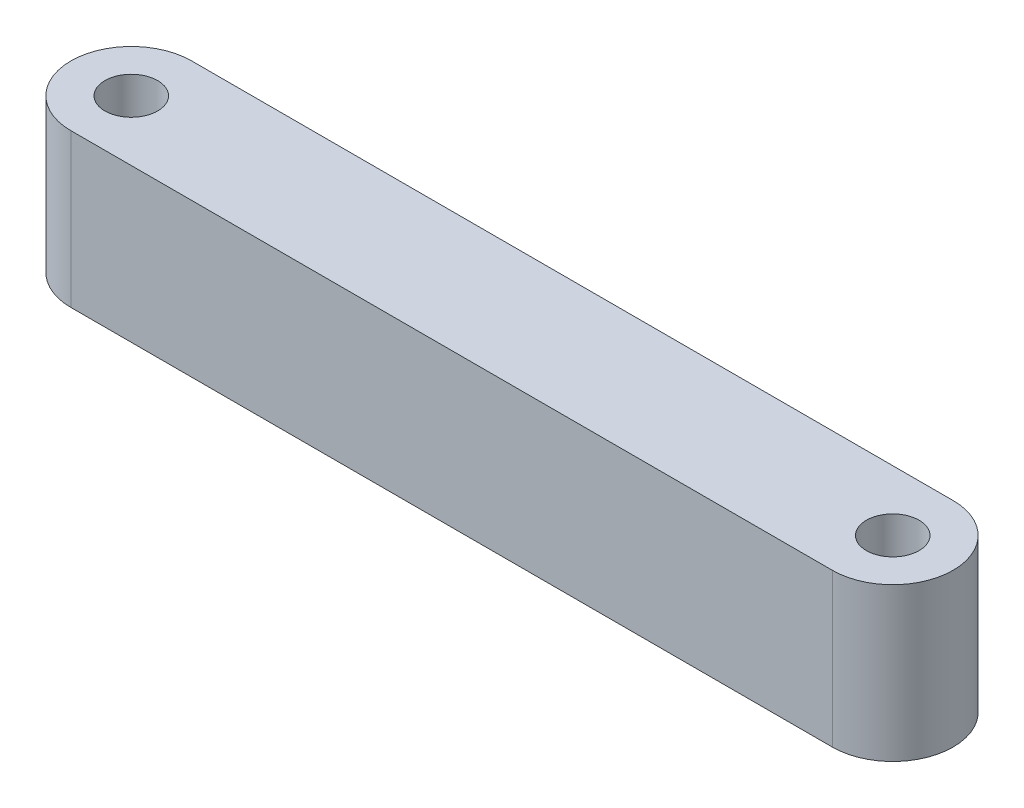
ISO-10303-21;
HEADER;
FILE_DESCRIPTION(('STEP AP214'),'2;1');
FILE_NAME('part.step','',(''),(''),'','','');
FILE_SCHEMA(('AUTOMOTIVE_DESIGN { 1 0 10303 214 1 1 1 1 }'));
ENDSEC;
DATA;
#1=APPLICATION_CONTEXT('core data for automotive mechanical design processes');
#2=APPLICATION_PROTOCOL_DEFINITION('international standard','automotive_design',2000,#1);
#3=PRODUCT_CONTEXT('',#1,'mechanical');
#4=PRODUCT('Part','Part','',(#3));
#5=PRODUCT_RELATED_PRODUCT_CATEGORY('part','',(#4));
#6=PRODUCT_DEFINITION_FORMATION('','',#4);
#7=PRODUCT_DEFINITION_CONTEXT('part definition',#1,'design');
#8=PRODUCT_DEFINITION('design','',#6,#7);
#9=PRODUCT_DEFINITION_SHAPE('','',#8);
#10=(LENGTH_UNIT() NAMED_UNIT(*) SI_UNIT(.MILLI.,.METRE.));
#11=(NAMED_UNIT(*) PLANE_ANGLE_UNIT() SI_UNIT($,.RADIAN.));
#12=(NAMED_UNIT(*) SI_UNIT($,.STERADIAN.) SOLID_ANGLE_UNIT());
#13=UNCERTAINTY_MEASURE_WITH_UNIT(LENGTH_MEASURE(1.E-05),#10,'distance_accuracy_value','');
#14=(GEOMETRIC_REPRESENTATION_CONTEXT(3) GLOBAL_UNCERTAINTY_ASSIGNED_CONTEXT((#13)) GLOBAL_UNIT_ASSIGNED_CONTEXT((#10,
#11,#12)) REPRESENTATION_CONTEXT('',''));
#15=CARTESIAN_POINT('',(0.,0.,0.));
#16=DIRECTION('',(0.,0.,1.));
#17=DIRECTION('',(1.,0.,0.));
#18=AXIS2_PLACEMENT_3D('',#15,#16,#17);
#19=CARTESIAN_POINT('',(-22.9449751224113,9.,0.));
#20=DIRECTION('',(0.,1.,0.));
#21=DIRECTION('',(0.,0.,1.));
#22=AXIS2_PLACEMENT_3D('',#19,#20,#21);
#23=PLANE('',#22);
#24=CARTESIAN_POINT('',(-22.9449751224113,9.,0.));
#25=DIRECTION('',(0.,1.,0.));
#26=DIRECTION('',(0.,0.,1.));
#27=AXIS2_PLACEMENT_3D('',#24,#25,#26);
#28=CIRCLE('',#27,1.55);
#29=CARTESIAN_POINT('',(-22.9449751224113,9.,1.55));
#30=VERTEX_POINT('',#29);
#31=EDGE_CURVE('E118',#30,#30,#28,.T.);
#32=ORIENTED_EDGE('',*,*,#31,.F.);
#33=EDGE_LOOP('',(#32));
#34=FACE_BOUND('',#33,.T.);
#35=CARTESIAN_POINT('',(-22.9449751224113,9.,0.));
#36=DIRECTION('',(0.,1.,0.));
#37=DIRECTION('',(0.,0.,1.));
#38=AXIS2_PLACEMENT_3D('',#35,#36,#37);
#39=CIRCLE('',#38,3.55);
#40=CARTESIAN_POINT('',(-22.9449751224113,9.,-3.55));
#41=VERTEX_POINT('',#40);
#42=CARTESIAN_POINT('',(-22.9449751224113,9.,3.55));
#43=VERTEX_POINT('',#42);
#44=EDGE_CURVE('E98',#41,#43,#39,.T.);
#45=ORIENTED_EDGE('',*,*,#44,.T.);
#46=DIRECTION('',(1.,0.,0.));
#47=VECTOR('',#46,1.);
#48=CARTESIAN_POINT('',(-22.9449751224113,9.,3.55));
#49=LINE('',#48,#47);
#50=CARTESIAN_POINT('',(21.8100248775887,9.,3.55));
#51=VERTEX_POINT('',#50);
#52=EDGE_CURVE('E93',#43,#51,#49,.T.);
#53=ORIENTED_EDGE('',*,*,#52,.T.);
#54=CARTESIAN_POINT('',(21.8100248775888,9.,0.));
#55=DIRECTION('',(0.,1.,0.));
#56=DIRECTION('',(0.,0.,1.));
#57=AXIS2_PLACEMENT_3D('',#54,#55,#56);
#58=CIRCLE('',#57,3.55);
#59=CARTESIAN_POINT('',(21.8100248775887,9.,-3.55));
#60=VERTEX_POINT('',#59);
#61=EDGE_CURVE('E96',#51,#60,#58,.T.);
#62=ORIENTED_EDGE('',*,*,#61,.T.);
#63=DIRECTION('',(-1.,0.,0.));
#64=VECTOR('',#63,1.);
#65=CARTESIAN_POINT('',(-22.9449751224113,9.,-3.55));
#66=LINE('',#65,#64);
#67=EDGE_CURVE('E63',#60,#41,#66,.T.);
#68=ORIENTED_EDGE('',*,*,#67,.T.);
#69=EDGE_LOOP('',(#45,#53,#62,#68));
#70=FACE_BOUND('',#69,.T.);
#71=CARTESIAN_POINT('',(21.8100248775888,9.,0.));
#72=DIRECTION('',(0.,1.,0.));
#73=DIRECTION('',(0.,0.,1.));
#74=AXIS2_PLACEMENT_3D('',#71,#72,#73);
#75=CIRCLE('',#74,1.55);
#76=CARTESIAN_POINT('',(21.8100248775888,9.,1.55));
#77=VERTEX_POINT('',#76);
#78=EDGE_CURVE('E140',#77,#77,#75,.T.);
#79=ORIENTED_EDGE('',*,*,#78,.F.);
#80=EDGE_LOOP('',(#79));
#81=FACE_BOUND('',#80,.T.);
#82=ADVANCED_FACE('F45',(#34,#70,#81),#23,.T.);
#83=CARTESIAN_POINT('',(-22.9449751224113,0.,0.));
#84=DIRECTION('',(0.,1.,0.));
#85=DIRECTION('',(0.,0.,1.));
#86=AXIS2_PLACEMENT_3D('',#83,#84,#85);
#87=PLANE('',#86);
#88=CARTESIAN_POINT('',(-22.9449751224113,0.,0.));
#89=DIRECTION('',(0.,1.,0.));
#90=DIRECTION('',(0.,0.,1.));
#91=AXIS2_PLACEMENT_3D('',#88,#89,#90);
#92=CIRCLE('',#91,3.55);
#93=CARTESIAN_POINT('',(-22.9449751224113,0.,-3.55));
#94=VERTEX_POINT('',#93);
#95=CARTESIAN_POINT('',(-22.9449751224113,0.,3.55));
#96=VERTEX_POINT('',#95);
#97=EDGE_CURVE('E114',#94,#96,#92,.T.);
#98=ORIENTED_EDGE('',*,*,#97,.F.);
#99=DIRECTION('',(-1.,0.,0.));
#100=VECTOR('',#99,1.);
#101=CARTESIAN_POINT('',(-22.9449751224113,0.,-3.55));
#102=LINE('',#101,#100);
#103=CARTESIAN_POINT('',(21.8100248775887,0.,-3.55));
#104=VERTEX_POINT('',#103);
#105=EDGE_CURVE('E86',#104,#94,#102,.T.);
#106=ORIENTED_EDGE('',*,*,#105,.F.);
#107=CARTESIAN_POINT('',(21.8100248775888,0.,0.));
#108=DIRECTION('',(0.,1.,0.));
#109=DIRECTION('',(0.,0.,1.));
#110=AXIS2_PLACEMENT_3D('',#107,#108,#109);
#111=CIRCLE('',#110,3.55);
#112=CARTESIAN_POINT('',(21.8100248775887,0.,3.55));
#113=VERTEX_POINT('',#112);
#114=EDGE_CURVE('E80',#113,#104,#111,.T.);
#115=ORIENTED_EDGE('',*,*,#114,.F.);
#116=DIRECTION('',(1.,0.,0.));
#117=VECTOR('',#116,1.);
#118=CARTESIAN_POINT('',(-22.9449751224113,0.,3.55));
#119=LINE('',#118,#117);
#120=EDGE_CURVE('E103',#96,#113,#119,.T.);
#121=ORIENTED_EDGE('',*,*,#120,.F.);
#122=EDGE_LOOP('',(#98,#106,#115,#121));
#123=FACE_BOUND('',#122,.T.);
#124=CARTESIAN_POINT('',(-22.9449751224113,0.,0.));
#125=DIRECTION('',(0.,1.,0.));
#126=DIRECTION('',(0.,0.,1.));
#127=AXIS2_PLACEMENT_3D('',#124,#125,#126);
#128=CIRCLE('',#127,1.55);
#129=CARTESIAN_POINT('',(-22.9449751224113,0.,1.55));
#130=VERTEX_POINT('',#129);
#131=EDGE_CURVE('E136',#130,#130,#128,.T.);
#132=ORIENTED_EDGE('',*,*,#131,.T.);
#133=EDGE_LOOP('',(#132));
#134=FACE_BOUND('',#133,.T.);
#135=CARTESIAN_POINT('',(21.8100248775888,0.,0.));
#136=DIRECTION('',(0.,1.,0.));
#137=DIRECTION('',(0.,0.,1.));
#138=AXIS2_PLACEMENT_3D('',#135,#136,#137);
#139=CIRCLE('',#138,1.55);
#140=CARTESIAN_POINT('',(21.8100248775888,0.,1.55));
#141=VERTEX_POINT('',#140);
#142=EDGE_CURVE('E144',#141,#141,#139,.T.);
#143=ORIENTED_EDGE('',*,*,#142,.T.);
#144=EDGE_LOOP('',(#143));
#145=FACE_BOUND('',#144,.T.);
#146=ADVANCED_FACE('F131',(#123,#134,#145),#87,.F.);
#147=CARTESIAN_POINT('',(-22.9449751224113,9.,0.));
#148=DIRECTION('',(0.,-1.,0.));
#149=DIRECTION('',(0.,0.,-1.));
#150=AXIS2_PLACEMENT_3D('',#147,#148,#149);
#151=CYLINDRICAL_SURFACE('',#150,3.55);
#152=ORIENTED_EDGE('',*,*,#97,.T.);
#153=DIRECTION('',(0.,-1.,0.));
#154=VECTOR('',#153,1.);
#155=CARTESIAN_POINT('',(-22.9449751224113,9.,3.55));
#156=LINE('',#155,#154);
#157=EDGE_CURVE('E11',#43,#96,#156,.T.);
#158=ORIENTED_EDGE('',*,*,#157,.F.);
#159=ORIENTED_EDGE('',*,*,#44,.F.);
#160=DIRECTION('',(0.,-1.,0.));
#161=VECTOR('',#160,1.);
#162=CARTESIAN_POINT('',(-22.9449751224113,9.,-3.55));
#163=LINE('',#162,#161);
#164=EDGE_CURVE('E110',#41,#94,#163,.T.);
#165=ORIENTED_EDGE('',*,*,#164,.T.);
#166=EDGE_LOOP('',(#152,#158,#159,#165));
#167=FACE_BOUND('',#166,.T.);
#168=ADVANCED_FACE('F47',(#167),#151,.T.);
#169=CARTESIAN_POINT('',(-22.9449751224113,9.,3.55));
#170=DIRECTION('',(0.,0.,-1.));
#171=DIRECTION('',(-1.,0.,0.));
#172=AXIS2_PLACEMENT_3D('',#169,#170,#171);
#173=PLANE('',#172);
#174=ORIENTED_EDGE('',*,*,#120,.T.);
#175=DIRECTION('',(0.,-1.,0.));
#176=VECTOR('',#175,1.);
#177=CARTESIAN_POINT('',(21.8100248775887,9.,3.55));
#178=LINE('',#177,#176);
#179=EDGE_CURVE('E55',#51,#113,#178,.T.);
#180=ORIENTED_EDGE('',*,*,#179,.F.);
#181=ORIENTED_EDGE('',*,*,#52,.F.);
#182=ORIENTED_EDGE('',*,*,#157,.T.);
#183=EDGE_LOOP('',(#174,#180,#181,#182));
#184=FACE_BOUND('',#183,.T.);
#185=ADVANCED_FACE('F102',(#184),#173,.F.);
#186=CARTESIAN_POINT('',(21.8100248775888,9.,0.));
#187=DIRECTION('',(0.,-1.,0.));
#188=DIRECTION('',(0.,0.,-1.));
#189=AXIS2_PLACEMENT_3D('',#186,#187,#188);
#190=CYLINDRICAL_SURFACE('',#189,3.55);
#191=ORIENTED_EDGE('',*,*,#114,.T.);
#192=DIRECTION('',(0.,-1.,0.));
#193=VECTOR('',#192,1.);
#194=CARTESIAN_POINT('',(21.8100248775887,9.,-3.55));
#195=LINE('',#194,#193);
#196=EDGE_CURVE('E105',#60,#104,#195,.T.);
#197=ORIENTED_EDGE('',*,*,#196,.F.);
#198=ORIENTED_EDGE('',*,*,#61,.F.);
#199=ORIENTED_EDGE('',*,*,#179,.T.);
#200=EDGE_LOOP('',(#191,#197,#198,#199));
#201=FACE_BOUND('',#200,.T.);
#202=ADVANCED_FACE('F106',(#201),#190,.T.);
#203=CARTESIAN_POINT('',(-22.9449751224113,9.,-3.55));
#204=DIRECTION('',(0.,0.,1.));
#205=DIRECTION('',(1.,0.,0.));
#206=AXIS2_PLACEMENT_3D('',#203,#204,#205);
#207=PLANE('',#206);
#208=ORIENTED_EDGE('',*,*,#105,.T.);
#209=ORIENTED_EDGE('',*,*,#164,.F.);
#210=ORIENTED_EDGE('',*,*,#67,.F.);
#211=ORIENTED_EDGE('',*,*,#196,.T.);
#212=EDGE_LOOP('',(#208,#209,#210,#211));
#213=FACE_BOUND('',#212,.T.);
#214=ADVANCED_FACE('F128',(#213),#207,.F.);
#215=CARTESIAN_POINT('',(-22.9449751224113,9.,0.));
#216=DIRECTION('',(0.,-1.,0.));
#217=DIRECTION('',(0.,0.,-1.));
#218=AXIS2_PLACEMENT_3D('',#215,#216,#217);
#219=CYLINDRICAL_SURFACE('',#218,1.55);
#220=ORIENTED_EDGE('',*,*,#31,.T.);
#221=EDGE_LOOP('',(#220));
#222=FACE_BOUND('',#221,.T.);
#223=ORIENTED_EDGE('',*,*,#131,.F.);
#224=EDGE_LOOP('',(#223));
#225=FACE_BOUND('',#224,.T.);
#226=ADVANCED_FACE('F163',(#222,#225),#219,.F.);
#227=CARTESIAN_POINT('',(21.8100248775888,9.,0.));
#228=DIRECTION('',(0.,-1.,0.));
#229=DIRECTION('',(0.,0.,-1.));
#230=AXIS2_PLACEMENT_3D('',#227,#228,#229);
#231=CYLINDRICAL_SURFACE('',#230,1.55);
#232=ORIENTED_EDGE('',*,*,#78,.T.);
#233=EDGE_LOOP('',(#232));
#234=FACE_BOUND('',#233,.T.);
#235=ORIENTED_EDGE('',*,*,#142,.F.);
#236=EDGE_LOOP('',(#235));
#237=FACE_BOUND('',#236,.T.);
#238=ADVANCED_FACE('F152',(#234,#237),#231,.F.);
#239=CLOSED_SHELL('',(#82,#146,#168,#185,#202,#214,#226,#238));
#240=MANIFOLD_SOLID_BREP('B2',#239);
#241=ADVANCED_BREP_SHAPE_REPRESENTATION('',(#18,#240),#14);
#242=SHAPE_DEFINITION_REPRESENTATION(#9,#241);
ENDSEC;
END-ISO-10303-21;
